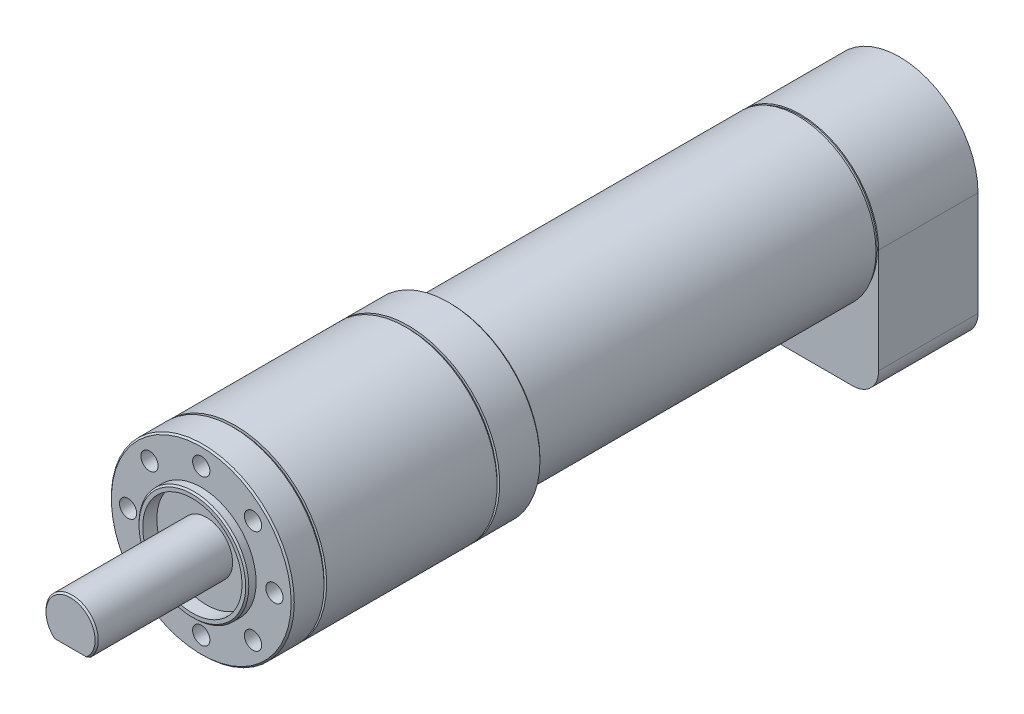
ISO-10303-21;
HEADER;
FILE_DESCRIPTION(('STEP AP214'),'2;1');
FILE_NAME('part.step','',(''),(''),'','','');
FILE_SCHEMA(('AUTOMOTIVE_DESIGN { 1 0 10303 214 1 1 1 1 }'));
ENDSEC;
DATA;
#1=APPLICATION_CONTEXT('core data for automotive mechanical design processes');
#2=APPLICATION_PROTOCOL_DEFINITION('international standard','automotive_design',2000,#1);
#3=PRODUCT_CONTEXT('',#1,'mechanical');
#4=PRODUCT('Part','Part','',(#3));
#5=PRODUCT_RELATED_PRODUCT_CATEGORY('part','',(#4));
#6=PRODUCT_DEFINITION_FORMATION('','',#4);
#7=PRODUCT_DEFINITION_CONTEXT('part definition',#1,'design');
#8=PRODUCT_DEFINITION('design','',#6,#7);
#9=PRODUCT_DEFINITION_SHAPE('','',#8);
#10=(LENGTH_UNIT() NAMED_UNIT(*) SI_UNIT(.MILLI.,.METRE.));
#11=(NAMED_UNIT(*) PLANE_ANGLE_UNIT() SI_UNIT($,.RADIAN.));
#12=(NAMED_UNIT(*) SI_UNIT($,.STERADIAN.) SOLID_ANGLE_UNIT());
#13=UNCERTAINTY_MEASURE_WITH_UNIT(LENGTH_MEASURE(1.E-05),#10,'distance_accuracy_value','');
#14=(GEOMETRIC_REPRESENTATION_CONTEXT(3) GLOBAL_UNCERTAINTY_ASSIGNED_CONTEXT((#13)) GLOBAL_UNIT_ASSIGNED_CONTEXT((#10,
#11,#12)) REPRESENTATION_CONTEXT('',''));
#15=CARTESIAN_POINT('',(0.,0.,0.));
#16=DIRECTION('',(0.,0.,1.));
#17=DIRECTION('',(1.,0.,0.));
#18=AXIS2_PLACEMENT_3D('',#15,#16,#17);
#19=CARTESIAN_POINT('',(0.,0.,47.6));
#20=DIRECTION('',(0.,0.,-1.));
#21=DIRECTION('',(-1.,0.,0.));
#22=AXIS2_PLACEMENT_3D('',#19,#20,#21);
#23=CYLINDRICAL_SURFACE('',#22,17.5);
#24=CARTESIAN_POINT('',(0.,0.,41.1));
#25=DIRECTION('',(0.,0.,1.));
#26=DIRECTION('',(1.,0.,0.));
#27=AXIS2_PLACEMENT_3D('',#24,#25,#26);
#28=CIRCLE('',#27,17.5);
#29=CARTESIAN_POINT('',(17.5,0.,41.1));
#30=VERTEX_POINT('',#29);
#31=EDGE_CURVE('E325',#30,#30,#28,.T.);
#32=ORIENTED_EDGE('',*,*,#31,.F.);
#33=EDGE_LOOP('',(#32));
#34=FACE_BOUND('',#33,.T.);
#35=CARTESIAN_POINT('',(0.,0.,8.5));
#36=DIRECTION('',(0.,0.,-1.));
#37=DIRECTION('',(-1.,0.,0.));
#38=AXIS2_PLACEMENT_3D('',#35,#36,#37);
#39=CIRCLE('',#38,17.5);
#40=CARTESIAN_POINT('',(-17.5,0.,8.5));
#41=VERTEX_POINT('',#40);
#42=EDGE_CURVE('E303',#41,#41,#39,.T.);
#43=ORIENTED_EDGE('',*,*,#42,.F.);
#44=EDGE_LOOP('',(#43));
#45=FACE_BOUND('',#44,.T.);
#46=ADVANCED_FACE('F40',(#34,#45),#23,.T.);
#47=CARTESIAN_POINT('',(0.,0.,46.6));
#48=DIRECTION('',(0.,0.,1.));
#49=DIRECTION('',(1.,0.,0.));
#50=AXIS2_PLACEMENT_3D('',#47,#48,#49);
#51=PLANE('',#50);
#52=CARTESIAN_POINT('',(0.,0.,46.6));
#53=DIRECTION('',(0.,0.,1.));
#54=DIRECTION('',(1.,0.,0.));
#55=AXIS2_PLACEMENT_3D('',#52,#53,#54);
#56=CIRCLE('',#55,9.5);
#57=CARTESIAN_POINT('',(9.5,0.,46.6));
#58=VERTEX_POINT('',#57);
#59=EDGE_CURVE('E433',#58,#58,#56,.T.);
#60=ORIENTED_EDGE('',*,*,#59,.T.);
#61=EDGE_LOOP('',(#60));
#62=FACE_BOUND('',#61,.T.);
#63=CARTESIAN_POINT('',(0.,0.,46.6));
#64=DIRECTION('',(0.,0.,1.));
#65=DIRECTION('',(1.,0.,0.));
#66=AXIS2_PLACEMENT_3D('',#63,#64,#65);
#67=CIRCLE('',#66,5.);
#68=CARTESIAN_POINT('',(5.,0.,46.6));
#69=VERTEX_POINT('',#68);
#70=EDGE_CURVE('E418',#69,#69,#67,.T.);
#71=ORIENTED_EDGE('',*,*,#70,.F.);
#72=EDGE_LOOP('',(#71));
#73=FACE_BOUND('',#72,.T.);
#74=ADVANCED_FACE('F248',(#62,#73),#51,.T.);
#75=CARTESIAN_POINT('',(0.,0.,47.6));
#76=DIRECTION('',(0.,0.,1.));
#77=DIRECTION('',(1.,0.,0.));
#78=AXIS2_PLACEMENT_3D('',#75,#76,#77);
#79=PLANE('',#78);
#80=CARTESIAN_POINT('',(0.,0.,47.6));
#81=DIRECTION('',(0.,0.,1.));
#82=DIRECTION('',(1.,0.,0.));
#83=AXIS2_PLACEMENT_3D('',#80,#81,#82);
#84=CIRCLE('',#83,17.2);
#85=CARTESIAN_POINT('',(17.2,0.,47.6));
#86=VERTEX_POINT('',#85);
#87=EDGE_CURVE('E191',#86,#86,#84,.T.);
#88=ORIENTED_EDGE('',*,*,#87,.T.);
#89=EDGE_LOOP('',(#88));
#90=FACE_BOUND('',#89,.T.);
#91=CARTESIAN_POINT('',(0.,14.,47.6));
#92=DIRECTION('',(0.,0.,1.));
#93=DIRECTION('',(1.,0.,0.));
#94=AXIS2_PLACEMENT_3D('',#91,#92,#93);
#95=CIRCLE('',#94,1.64999999999999);
#96=CARTESIAN_POINT('',(1.64999999999999,14.,47.6));
#97=VERTEX_POINT('',#96);
#98=EDGE_CURVE('E329',#97,#97,#95,.T.);
#99=ORIENTED_EDGE('',*,*,#98,.F.);
#100=EDGE_LOOP('',(#99));
#101=FACE_BOUND('',#100,.T.);
#102=CARTESIAN_POINT('',(-9.89949493661155,9.89949493661138,47.6));
#103=DIRECTION('',(0.,0.,1.));
#104=DIRECTION('',(1.,0.,0.));
#105=AXIS2_PLACEMENT_3D('',#102,#103,#104);
#106=CIRCLE('',#105,1.64999999999999);
#107=CARTESIAN_POINT('',(-8.24949493661156,9.89949493661138,47.6));
#108=VERTEX_POINT('',#107);
#109=EDGE_CURVE('E340',#108,#108,#106,.T.);
#110=ORIENTED_EDGE('',*,*,#109,.F.);
#111=EDGE_LOOP('',(#110));
#112=FACE_BOUND('',#111,.T.);
#113=CARTESIAN_POINT('',(-13.9999999999996,-3.97903932025656E-13,47.6));
#114=DIRECTION('',(0.,0.,1.));
#115=DIRECTION('',(1.,0.,0.));
#116=AXIS2_PLACEMENT_3D('',#113,#114,#115);
#117=CIRCLE('',#116,1.64999999999999);
#118=CARTESIAN_POINT('',(-12.3499999999996,-3.97903932025656E-13,47.6));
#119=VERTEX_POINT('',#118);
#120=EDGE_CURVE('E348',#119,#119,#117,.T.);
#121=ORIENTED_EDGE('',*,*,#120,.F.);
#122=EDGE_LOOP('',(#121));
#123=FACE_BOUND('',#122,.T.);
#124=CARTESIAN_POINT('',(-9.89949493661099,-9.89949493661195,47.6));
#125=DIRECTION('',(0.,0.,1.));
#126=DIRECTION('',(1.,0.,0.));
#127=AXIS2_PLACEMENT_3D('',#124,#125,#126);
#128=CIRCLE('',#127,1.64999999999999);
#129=CARTESIAN_POINT('',(-8.249494936611,-9.89949493661195,47.6));
#130=VERTEX_POINT('',#129);
#131=EDGE_CURVE('E356',#130,#130,#128,.T.);
#132=ORIENTED_EDGE('',*,*,#131,.F.);
#133=EDGE_LOOP('',(#132));
#134=FACE_BOUND('',#133,.T.);
#135=CARTESIAN_POINT('',(7.923788530137E-13,-14.,47.6));
#136=DIRECTION('',(0.,0.,1.));
#137=DIRECTION('',(1.,0.,0.));
#138=AXIS2_PLACEMENT_3D('',#135,#136,#137);
#139=CIRCLE('',#138,1.64999999999999);
#140=CARTESIAN_POINT('',(1.65000000000078,-14.,47.6));
#141=VERTEX_POINT('',#140);
#142=EDGE_CURVE('E364',#141,#141,#139,.T.);
#143=ORIENTED_EDGE('',*,*,#142,.F.);
#144=EDGE_LOOP('',(#143));
#145=FACE_BOUND('',#144,.T.);
#146=CARTESIAN_POINT('',(9.89949493661234,-9.89949493661139,47.6));
#147=DIRECTION('',(0.,0.,1.));
#148=DIRECTION('',(1.,0.,0.));
#149=AXIS2_PLACEMENT_3D('',#146,#147,#148);
#150=CIRCLE('',#149,1.64999999999999);
#151=CARTESIAN_POINT('',(11.5494949366123,-9.89949493661139,47.6));
#152=VERTEX_POINT('',#151);
#153=EDGE_CURVE('E372',#152,#152,#150,.T.);
#154=ORIENTED_EDGE('',*,*,#153,.F.);
#155=EDGE_LOOP('',(#154));
#156=FACE_BOUND('',#155,.T.);
#157=CARTESIAN_POINT('',(14.0000000000004,3.9618942650685E-13,47.6));
#158=DIRECTION('',(0.,0.,1.));
#159=DIRECTION('',(1.,0.,0.));
#160=AXIS2_PLACEMENT_3D('',#157,#158,#159);
#161=CIRCLE('',#160,1.64999999999999);
#162=CARTESIAN_POINT('',(15.6500000000004,3.9618942650685E-13,47.6));
#163=VERTEX_POINT('',#162);
#164=EDGE_CURVE('E380',#163,#163,#161,.T.);
#165=ORIENTED_EDGE('',*,*,#164,.F.);
#166=EDGE_LOOP('',(#165));
#167=FACE_BOUND('',#166,.T.);
#168=CARTESIAN_POINT('',(9.89949493661168,9.89949493661165,47.6));
#169=DIRECTION('',(0.,0.,1.));
#170=DIRECTION('',(1.,0.,0.));
#171=AXIS2_PLACEMENT_3D('',#168,#169,#170);
#172=CIRCLE('',#171,1.64999999999999);
#173=CARTESIAN_POINT('',(11.5494949366117,9.89949493661165,47.6));
#174=VERTEX_POINT('',#173);
#175=EDGE_CURVE('E388',#174,#174,#172,.T.);
#176=ORIENTED_EDGE('',*,*,#175,.F.);
#177=EDGE_LOOP('',(#176));
#178=FACE_BOUND('',#177,.T.);
#179=CARTESIAN_POINT('',(0.,0.,47.6));
#180=DIRECTION('',(0.,0.,1.));
#181=DIRECTION('',(1.,0.,0.));
#182=AXIS2_PLACEMENT_3D('',#179,#180,#181);
#183=CIRCLE('',#182,10.5);
#184=CARTESIAN_POINT('',(10.5,0.,47.6));
#185=VERTEX_POINT('',#184);
#186=EDGE_CURVE('E429',#185,#185,#183,.T.);
#187=ORIENTED_EDGE('',*,*,#186,.F.);
#188=EDGE_LOOP('',(#187));
#189=FACE_BOUND('',#188,.T.);
#190=ADVANCED_FACE('F251',(#90,#101,#112,#123,#134,#145,#156,#167,#178,#189),#79,.T.);
#191=CARTESIAN_POINT('',(0.,0.,47.3));
#192=DIRECTION('',(0.,0.,1.));
#193=DIRECTION('',(1.,0.,0.));
#194=AXIS2_PLACEMENT_3D('',#191,#192,#193);
#195=CIRCLE('',#194,17.5);
#196=CARTESIAN_POINT('',(17.5,0.,47.3));
#197=VERTEX_POINT('',#196);
#198=EDGE_CURVE('E195',#197,#197,#195,.F.);
#199=ORIENTED_EDGE('',*,*,#198,.T.);
#200=EDGE_LOOP('',(#199));
#201=FACE_BOUND('',#200,.T.);
#202=CARTESIAN_POINT('',(0.,0.,41.6));
#203=DIRECTION('',(0.,0.,1.));
#204=DIRECTION('',(1.,0.,0.));
#205=AXIS2_PLACEMENT_3D('',#202,#203,#204);
#206=CIRCLE('',#205,17.5);
#207=CARTESIAN_POINT('',(17.5,0.,41.6));
#208=VERTEX_POINT('',#207);
#209=EDGE_CURVE('E321',#208,#208,#206,.T.);
#210=ORIENTED_EDGE('',*,*,#209,.T.);
#211=EDGE_LOOP('',(#210));
#212=FACE_BOUND('',#211,.T.);
#213=ADVANCED_FACE('F243',(#201,#212),#23,.T.);
#214=CARTESIAN_POINT('',(0.,0.,49.3));
#215=DIRECTION('',(0.,0.,1.));
#216=DIRECTION('',(1.,0.,0.));
#217=AXIS2_PLACEMENT_3D('',#214,#215,#216);
#218=PLANE('',#217);
#219=CARTESIAN_POINT('',(0.,0.,49.3));
#220=DIRECTION('',(0.,0.,1.));
#221=DIRECTION('',(1.,0.,0.));
#222=AXIS2_PLACEMENT_3D('',#219,#220,#221);
#223=CIRCLE('',#222,10.2);
#224=CARTESIAN_POINT('',(10.2,0.,49.3));
#225=VERTEX_POINT('',#224);
#226=EDGE_CURVE('E473',#225,#225,#223,.T.);
#227=ORIENTED_EDGE('',*,*,#226,.T.);
#228=EDGE_LOOP('',(#227));
#229=FACE_BOUND('',#228,.T.);
#230=CARTESIAN_POINT('',(0.,0.,49.3));
#231=DIRECTION('',(0.,0.,1.));
#232=DIRECTION('',(1.,0.,0.));
#233=AXIS2_PLACEMENT_3D('',#230,#231,#232);
#234=CIRCLE('',#233,9.5);
#235=CARTESIAN_POINT('',(9.5,0.,49.3));
#236=VERTEX_POINT('',#235);
#237=EDGE_CURVE('E425',#236,#236,#234,.T.);
#238=ORIENTED_EDGE('',*,*,#237,.F.);
#239=EDGE_LOOP('',(#238));
#240=FACE_BOUND('',#239,.T.);
#241=ADVANCED_FACE('F239',(#229,#240),#218,.T.);
#242=CARTESIAN_POINT('',(0.,0.,49.3));
#243=DIRECTION('',(0.,0.,-1.));
#244=DIRECTION('',(-1.,0.,0.));
#245=AXIS2_PLACEMENT_3D('',#242,#243,#244);
#246=CYLINDRICAL_SURFACE('',#245,10.5);
#247=CARTESIAN_POINT('',(0.,0.,49.));
#248=DIRECTION('',(0.,0.,1.));
#249=DIRECTION('',(1.,0.,0.));
#250=AXIS2_PLACEMENT_3D('',#247,#248,#249);
#251=CIRCLE('',#250,10.5);
#252=CARTESIAN_POINT('',(10.5,0.,49.));
#253=VERTEX_POINT('',#252);
#254=EDGE_CURVE('E470',#253,#253,#251,.F.);
#255=ORIENTED_EDGE('',*,*,#254,.T.);
#256=EDGE_LOOP('',(#255));
#257=FACE_BOUND('',#256,.T.);
#258=ORIENTED_EDGE('',*,*,#186,.T.);
#259=EDGE_LOOP('',(#258));
#260=FACE_BOUND('',#259,.T.);
#261=ADVANCED_FACE('F242',(#257,#260),#246,.T.);
#262=CARTESIAN_POINT('',(0.,0.,46.6));
#263=DIRECTION('',(0.,0.,1.));
#264=DIRECTION('',(1.,0.,0.));
#265=AXIS2_PLACEMENT_3D('',#262,#263,#264);
#266=CYLINDRICAL_SURFACE('',#265,9.5);
#267=ORIENTED_EDGE('',*,*,#59,.F.);
#268=EDGE_LOOP('',(#267));
#269=FACE_BOUND('',#268,.T.);
#270=ORIENTED_EDGE('',*,*,#237,.T.);
#271=EDGE_LOOP('',(#270));
#272=FACE_BOUND('',#271,.T.);
#273=ADVANCED_FACE('F237',(#269,#272),#266,.F.);
#274=CARTESIAN_POINT('',(0.,0.,72.6));
#275=DIRECTION('',(0.,0.,-1.));
#276=DIRECTION('',(-1.,0.,0.));
#277=AXIS2_PLACEMENT_3D('',#274,#275,#276);
#278=CYLINDRICAL_SURFACE('',#277,5.);
#279=DIRECTION('',(0.,0.,1.));
#280=VECTOR('',#279,1.);
#281=CARTESIAN_POINT('',(-3.46987031457949,-3.6,52.6));
#282=LINE('',#281,#280);
#283=CARTESIAN_POINT('',(-3.46987031457949,-3.6,52.6));
#284=VERTEX_POINT('',#283);
#285=CARTESIAN_POINT('',(-3.46987031457949,-3.6,72.3000000000001));
#286=VERTEX_POINT('',#285);
#287=EDGE_CURVE('E414',#284,#286,#282,.T.);
#288=ORIENTED_EDGE('',*,*,#287,.T.);
#289=CARTESIAN_POINT('',(0.,0.,72.3000000000001));
#290=DIRECTION('',(0.,0.,1.));
#291=DIRECTION('',(1.,0.,0.));
#292=AXIS2_PLACEMENT_3D('',#289,#290,#291);
#293=CIRCLE('',#292,5.);
#294=CARTESIAN_POINT('',(3.46987031457949,-3.6,72.3000000000001));
#295=VERTEX_POINT('',#294);
#296=EDGE_CURVE('E478',#286,#295,#293,.F.);
#297=ORIENTED_EDGE('',*,*,#296,.T.);
#298=DIRECTION('',(0.,0.,1.));
#299=VECTOR('',#298,1.);
#300=CARTESIAN_POINT('',(3.46987031457949,-3.6,52.6));
#301=LINE('',#300,#299);
#302=CARTESIAN_POINT('',(3.46987031457949,-3.6,52.6));
#303=VERTEX_POINT('',#302);
#304=EDGE_CURVE('E412',#303,#295,#301,.T.);
#305=ORIENTED_EDGE('',*,*,#304,.F.);
#306=CARTESIAN_POINT('',(0.,0.,52.6));
#307=DIRECTION('',(0.,0.,1.));
#308=DIRECTION('',(1.,0.,0.));
#309=AXIS2_PLACEMENT_3D('',#306,#307,#308);
#310=CIRCLE('',#309,5.);
#311=EDGE_CURVE('E172',#284,#303,#310,.T.);
#312=ORIENTED_EDGE('',*,*,#311,.F.);
#313=EDGE_LOOP('',(#288,#297,#305,#312));
#314=FACE_BOUND('',#313,.T.);
#315=ORIENTED_EDGE('',*,*,#70,.T.);
#316=EDGE_LOOP('',(#315));
#317=FACE_BOUND('',#316,.T.);
#318=ADVANCED_FACE('F233',(#314,#317),#278,.T.);
#319=CARTESIAN_POINT('',(0.,0.,72.6));
#320=DIRECTION('',(0.,0.,1.));
#321=DIRECTION('',(1.,0.,0.));
#322=AXIS2_PLACEMENT_3D('',#319,#320,#321);
#323=PLANE('',#322);
#324=DIRECTION('',(-1.,0.,0.));
#325=VECTOR('',#324,1.);
#326=CARTESIAN_POINT('',(-3.46987031457949,-3.6,72.6));
#327=LINE('',#326,#325);
#328=CARTESIAN_POINT('',(3.02158898594777,-3.6,72.6));
#329=VERTEX_POINT('',#328);
#330=CARTESIAN_POINT('',(-3.02158898594777,-3.6,72.6));
#331=VERTEX_POINT('',#330);
#332=EDGE_CURVE('E166',#329,#331,#327,.T.);
#333=ORIENTED_EDGE('',*,*,#332,.F.);
#334=CARTESIAN_POINT('',(0.,0.,72.6));
#335=DIRECTION('',(0.,0.,1.));
#336=DIRECTION('',(1.,0.,0.));
#337=AXIS2_PLACEMENT_3D('',#334,#335,#336);
#338=CIRCLE('',#337,4.70000000000009);
#339=EDGE_CURVE('E198',#329,#331,#338,.T.);
#340=ORIENTED_EDGE('',*,*,#339,.T.);
#341=EDGE_LOOP('',(#333,#340));
#342=FACE_BOUND('',#341,.T.);
#343=ADVANCED_FACE('F227',(#342),#323,.T.);
#344=CARTESIAN_POINT('',(-3.46987031457949,-3.6,52.6));
#345=DIRECTION('',(0.,1.,0.));
#346=DIRECTION('',(0.,0.,1.));
#347=AXIS2_PLACEMENT_3D('',#344,#345,#346);
#348=PLANE('',#347);
#349=ORIENTED_EDGE('',*,*,#332,.T.);
#350=CARTESIAN_POINT('',(-3.02158898594777,-3.6,72.6));
#351=CARTESIAN_POINT('',(-3.05940313496446,-3.6,72.5756891863581));
#352=CARTESIAN_POINT('',(-3.09709565385285,-3.6,72.5511896855106));
#353=CARTESIAN_POINT('',(-3.17224613011656,-3.6,72.5018397791132));
#354=CARTESIAN_POINT('',(-3.20970410549203,-3.6,72.47698940098));
#355=CARTESIAN_POINT('',(-3.28439979449647,-3.6,72.4269606061702));
#356=CARTESIAN_POINT('',(-3.32163750973018,-3.6,72.401782191888));
#357=CARTESIAN_POINT('',(-3.39590666116629,-3.6,72.3511167277367));
#358=CARTESIAN_POINT('',(-3.4329380811145,-3.6,72.3256296540366));
#359=CARTESIAN_POINT('',(-3.4698703145795,-3.6,72.3000000000001));
#360=B_SPLINE_CURVE_WITH_KNOTS('',3,(#350,#351,#352,#353,#354,#355,#356,#357,#358,#359),
.UNSPECIFIED.,.F.,.F.,(4,2,2,2,4),(0.,0.134863164596307,0.26971584897253,0.404567549643002,
0.539429729244507),.UNSPECIFIED.);
#361=EDGE_CURVE('E211',#331,#286,#360,.T.);
#362=ORIENTED_EDGE('',*,*,#361,.T.);
#363=ORIENTED_EDGE('',*,*,#287,.F.);
#364=DIRECTION('',(-1.,0.,0.));
#365=VECTOR('',#364,1.);
#366=CARTESIAN_POINT('',(-3.46987031457949,-3.6,52.6));
#367=LINE('',#366,#365);
#368=EDGE_CURVE('E409',#303,#284,#367,.T.);
#369=ORIENTED_EDGE('',*,*,#368,.F.);
#370=ORIENTED_EDGE('',*,*,#304,.T.);
#371=CARTESIAN_POINT('',(3.46987031457949,-3.6,72.3000000000001));
#372=CARTESIAN_POINT('',(3.43293808111449,-3.6,72.3256296540366));
#373=CARTESIAN_POINT('',(3.39590666116629,-3.6,72.3511167277367));
#374=CARTESIAN_POINT('',(3.32163750973018,-3.6,72.401782191888));
#375=CARTESIAN_POINT('',(3.28439979449647,-3.6,72.4269606061702));
#376=CARTESIAN_POINT('',(3.20970410549204,-3.6,72.47698940098));
#377=CARTESIAN_POINT('',(3.17224613011656,-3.6,72.5018397791132));
#378=CARTESIAN_POINT('',(3.09709565385286,-3.6,72.5511896855107));
#379=CARTESIAN_POINT('',(3.05940313496447,-3.6,72.5756891863581));
#380=CARTESIAN_POINT('',(3.02158898594779,-3.6,72.6));
#381=B_SPLINE_CURVE_WITH_KNOTS('',3,(#371,#372,#373,#374,#375,#376,#377,#378,#379,#380),
.UNSPECIFIED.,.F.,.F.,(4,2,2,2,4),(0.,0.134862179601507,0.269713880271975,0.404566564648199,
0.539429729244504),.UNSPECIFIED.);
#382=EDGE_CURVE('E202',#295,#329,#381,.T.);
#383=ORIENTED_EDGE('',*,*,#382,.T.);
#384=EDGE_LOOP('',(#349,#362,#363,#369,#370,#383));
#385=FACE_BOUND('',#384,.T.);
#386=ADVANCED_FACE('F221',(#385),#348,.F.);
#387=CARTESIAN_POINT('',(0.,0.,52.6));
#388=DIRECTION('',(0.,0.,1.));
#389=DIRECTION('',(1.,0.,0.));
#390=AXIS2_PLACEMENT_3D('',#387,#388,#389);
#391=PLANE('',#390);
#392=ORIENTED_EDGE('',*,*,#311,.T.);
#393=ORIENTED_EDGE('',*,*,#368,.T.);
#394=EDGE_LOOP('',(#392,#393));
#395=FACE_BOUND('',#394,.T.);
#396=ADVANCED_FACE('F226',(#395),#391,.T.);
#397=CARTESIAN_POINT('',(9.89949493661168,9.89949493661165,39.6));
#398=DIRECTION('',(0.,0.,1.));
#399=DIRECTION('',(1.,0.,0.));
#400=AXIS2_PLACEMENT_3D('',#397,#398,#399);
#401=CONICAL_SURFACE('',#400,1.65,1.02974425867665);
#402=CARTESIAN_POINT('',(9.89949493661168,9.89949493661165,38.6085799786045));
#403=VERTEX_POINT('',#402);
#404=VERTEX_LOOP('',#403);
#405=FACE_BOUND('',#404,.T.);
#406=CARTESIAN_POINT('',(9.89949493661168,9.89949493661165,39.6));
#407=DIRECTION('',(0.,0.,1.));
#408=DIRECTION('',(1.,0.,0.));
#409=AXIS2_PLACEMENT_3D('',#406,#407,#408);
#410=CIRCLE('',#409,1.65);
#411=CARTESIAN_POINT('',(11.5494949366117,9.89949493661165,39.6));
#412=VERTEX_POINT('',#411);
#413=EDGE_CURVE('E160',#412,#412,#410,.T.);
#414=ORIENTED_EDGE('',*,*,#413,.T.);
#415=EDGE_LOOP('',(#414));
#416=FACE_BOUND('',#415,.T.);
#417=ADVANCED_FACE('F491',(#405,#416),#401,.F.);
#418=CARTESIAN_POINT('',(9.89949493661168,9.89949493661165,47.6));
#419=DIRECTION('',(0.,0.,1.));
#420=DIRECTION('',(1.,0.,0.));
#421=AXIS2_PLACEMENT_3D('',#418,#419,#420);
#422=CYLINDRICAL_SURFACE('',#421,1.64999999999999);
#423=ORIENTED_EDGE('',*,*,#413,.F.);
#424=EDGE_LOOP('',(#423));
#425=FACE_BOUND('',#424,.T.);
#426=ORIENTED_EDGE('',*,*,#175,.T.);
#427=EDGE_LOOP('',(#426));
#428=FACE_BOUND('',#427,.T.);
#429=ADVANCED_FACE('F495',(#425,#428),#422,.F.);
#430=CARTESIAN_POINT('',(14.0000000000004,3.9618942650685E-13,39.6));
#431=DIRECTION('',(0.,0.,1.));
#432=DIRECTION('',(1.,0.,0.));
#433=AXIS2_PLACEMENT_3D('',#430,#431,#432);
#434=CONICAL_SURFACE('',#433,1.65,1.02974425867665);
#435=CARTESIAN_POINT('',(14.0000000000004,3.9618942650685E-13,38.6085799786045));
#436=VERTEX_POINT('',#435);
#437=VERTEX_LOOP('',#436);
#438=FACE_BOUND('',#437,.T.);
#439=CARTESIAN_POINT('',(14.0000000000004,3.9618942650685E-13,39.6));
#440=DIRECTION('',(0.,0.,1.));
#441=DIRECTION('',(1.,0.,0.));
#442=AXIS2_PLACEMENT_3D('',#439,#440,#441);
#443=CIRCLE('',#442,1.65);
#444=CARTESIAN_POINT('',(15.6500000000004,3.9618942650685E-13,39.6));
#445=VERTEX_POINT('',#444);
#446=EDGE_CURVE('E384',#445,#445,#443,.T.);
#447=ORIENTED_EDGE('',*,*,#446,.T.);
#448=EDGE_LOOP('',(#447));
#449=FACE_BOUND('',#448,.T.);
#450=ADVANCED_FACE('F501',(#438,#449),#434,.F.);
#451=CARTESIAN_POINT('',(14.0000000000004,3.9618942650685E-13,47.6));
#452=DIRECTION('',(0.,0.,1.));
#453=DIRECTION('',(1.,0.,0.));
#454=AXIS2_PLACEMENT_3D('',#451,#452,#453);
#455=CYLINDRICAL_SURFACE('',#454,1.64999999999999);
#456=ORIENTED_EDGE('',*,*,#446,.F.);
#457=EDGE_LOOP('',(#456));
#458=FACE_BOUND('',#457,.T.);
#459=ORIENTED_EDGE('',*,*,#164,.T.);
#460=EDGE_LOOP('',(#459));
#461=FACE_BOUND('',#460,.T.);
#462=ADVANCED_FACE('F913',(#458,#461),#455,.F.);
#463=CARTESIAN_POINT('',(9.89949493661234,-9.89949493661139,39.6));
#464=DIRECTION('',(0.,0.,1.));
#465=DIRECTION('',(1.,0.,0.));
#466=AXIS2_PLACEMENT_3D('',#463,#464,#465);
#467=CONICAL_SURFACE('',#466,1.65,1.02974425867665);
#468=CARTESIAN_POINT('',(9.89949493661234,-9.89949493661139,38.6085799786045));
#469=VERTEX_POINT('',#468);
#470=VERTEX_LOOP('',#469);
#471=FACE_BOUND('',#470,.T.);
#472=CARTESIAN_POINT('',(9.89949493661234,-9.89949493661139,39.6));
#473=DIRECTION('',(0.,0.,1.));
#474=DIRECTION('',(1.,0.,0.));
#475=AXIS2_PLACEMENT_3D('',#472,#473,#474);
#476=CIRCLE('',#475,1.65);
#477=CARTESIAN_POINT('',(11.5494949366123,-9.89949493661139,39.6));
#478=VERTEX_POINT('',#477);
#479=EDGE_CURVE('E376',#478,#478,#476,.T.);
#480=ORIENTED_EDGE('',*,*,#479,.T.);
#481=EDGE_LOOP('',(#480));
#482=FACE_BOUND('',#481,.T.);
#483=ADVANCED_FACE('F901',(#471,#482),#467,.F.);
#484=CARTESIAN_POINT('',(9.89949493661234,-9.89949493661139,47.6));
#485=DIRECTION('',(0.,0.,1.));
#486=DIRECTION('',(1.,0.,0.));
#487=AXIS2_PLACEMENT_3D('',#484,#485,#486);
#488=CYLINDRICAL_SURFACE('',#487,1.64999999999999);
#489=ORIENTED_EDGE('',*,*,#479,.F.);
#490=EDGE_LOOP('',(#489));
#491=FACE_BOUND('',#490,.T.);
#492=ORIENTED_EDGE('',*,*,#153,.T.);
#493=EDGE_LOOP('',(#492));
#494=FACE_BOUND('',#493,.T.);
#495=ADVANCED_FACE('F891',(#491,#494),#488,.F.);
#496=CARTESIAN_POINT('',(7.923788530137E-13,-14.,39.6));
#497=DIRECTION('',(0.,0.,1.));
#498=DIRECTION('',(1.,0.,0.));
#499=AXIS2_PLACEMENT_3D('',#496,#497,#498);
#500=CONICAL_SURFACE('',#499,1.65,1.02974425867665);
#501=CARTESIAN_POINT('',(7.90176590263901E-13,-14.,38.6085799786045));
#502=VERTEX_POINT('',#501);
#503=VERTEX_LOOP('',#502);
#504=FACE_BOUND('',#503,.T.);
#505=CARTESIAN_POINT('',(7.923788530137E-13,-14.,39.6));
#506=DIRECTION('',(0.,0.,1.));
#507=DIRECTION('',(1.,0.,0.));
#508=AXIS2_PLACEMENT_3D('',#505,#506,#507);
#509=CIRCLE('',#508,1.65);
#510=CARTESIAN_POINT('',(1.65000000000079,-14.,39.6));
#511=VERTEX_POINT('',#510);
#512=EDGE_CURVE('E368',#511,#511,#509,.T.);
#513=ORIENTED_EDGE('',*,*,#512,.T.);
#514=EDGE_LOOP('',(#513));
#515=FACE_BOUND('',#514,.T.);
#516=ADVANCED_FACE('F879',(#504,#515),#500,.F.);
#517=CARTESIAN_POINT('',(7.923788530137E-13,-14.,47.6));
#518=DIRECTION('',(0.,0.,1.));
#519=DIRECTION('',(1.,0.,0.));
#520=AXIS2_PLACEMENT_3D('',#517,#518,#519);
#521=CYLINDRICAL_SURFACE('',#520,1.64999999999999);
#522=ORIENTED_EDGE('',*,*,#512,.F.);
#523=EDGE_LOOP('',(#522));
#524=FACE_BOUND('',#523,.T.);
#525=ORIENTED_EDGE('',*,*,#142,.T.);
#526=EDGE_LOOP('',(#525));
#527=FACE_BOUND('',#526,.T.);
#528=ADVANCED_FACE('F869',(#524,#527),#521,.F.);
#529=CARTESIAN_POINT('',(-9.89949493661099,-9.89949493661195,39.6));
#530=DIRECTION('',(0.,0.,1.));
#531=DIRECTION('',(1.,0.,0.));
#532=AXIS2_PLACEMENT_3D('',#529,#530,#531);
#533=CONICAL_SURFACE('',#532,1.65,1.02974425867665);
#534=CARTESIAN_POINT('',(-9.89949493661099,-9.89949493661195,38.6085799786045));
#535=VERTEX_POINT('',#534);
#536=VERTEX_LOOP('',#535);
#537=FACE_BOUND('',#536,.T.);
#538=CARTESIAN_POINT('',(-9.89949493661099,-9.89949493661195,39.6));
#539=DIRECTION('',(0.,0.,1.));
#540=DIRECTION('',(1.,0.,0.));
#541=AXIS2_PLACEMENT_3D('',#538,#539,#540);
#542=CIRCLE('',#541,1.65);
#543=CARTESIAN_POINT('',(-8.24949493661099,-9.89949493661195,39.6));
#544=VERTEX_POINT('',#543);
#545=EDGE_CURVE('E360',#544,#544,#542,.T.);
#546=ORIENTED_EDGE('',*,*,#545,.T.);
#547=EDGE_LOOP('',(#546));
#548=FACE_BOUND('',#547,.T.);
#549=ADVANCED_FACE('F857',(#537,#548),#533,.F.);
#550=CARTESIAN_POINT('',(-9.89949493661099,-9.89949493661195,47.6));
#551=DIRECTION('',(0.,0.,1.));
#552=DIRECTION('',(1.,0.,0.));
#553=AXIS2_PLACEMENT_3D('',#550,#551,#552);
#554=CYLINDRICAL_SURFACE('',#553,1.64999999999999);
#555=ORIENTED_EDGE('',*,*,#545,.F.);
#556=EDGE_LOOP('',(#555));
#557=FACE_BOUND('',#556,.T.);
#558=ORIENTED_EDGE('',*,*,#131,.T.);
#559=EDGE_LOOP('',(#558));
#560=FACE_BOUND('',#559,.T.);
#561=ADVANCED_FACE('F847',(#557,#560),#554,.F.);
#562=CARTESIAN_POINT('',(-13.9999999999996,-3.97903932025656E-13,39.6));
#563=DIRECTION('',(0.,0.,1.));
#564=DIRECTION('',(1.,0.,0.));
#565=AXIS2_PLACEMENT_3D('',#562,#563,#564);
#566=CONICAL_SURFACE('',#565,1.65,1.02974425867665);
#567=CARTESIAN_POINT('',(-13.9999999999996,-3.97903932025656E-13,38.6085799786045));
#568=VERTEX_POINT('',#567);
#569=VERTEX_LOOP('',#568);
#570=FACE_BOUND('',#569,.T.);
#571=CARTESIAN_POINT('',(-13.9999999999996,-3.97903932025656E-13,39.6));
#572=DIRECTION('',(0.,0.,1.));
#573=DIRECTION('',(1.,0.,0.));
#574=AXIS2_PLACEMENT_3D('',#571,#572,#573);
#575=CIRCLE('',#574,1.65);
#576=CARTESIAN_POINT('',(-12.3499999999996,-3.97903932025656E-13,39.6));
#577=VERTEX_POINT('',#576);
#578=EDGE_CURVE('E352',#577,#577,#575,.T.);
#579=ORIENTED_EDGE('',*,*,#578,.T.);
#580=EDGE_LOOP('',(#579));
#581=FACE_BOUND('',#580,.T.);
#582=ADVANCED_FACE('F835',(#570,#581),#566,.F.);
#583=CARTESIAN_POINT('',(-13.9999999999996,-3.97903932025656E-13,47.6));
#584=DIRECTION('',(0.,0.,1.));
#585=DIRECTION('',(1.,0.,0.));
#586=AXIS2_PLACEMENT_3D('',#583,#584,#585);
#587=CYLINDRICAL_SURFACE('',#586,1.64999999999999);
#588=ORIENTED_EDGE('',*,*,#578,.F.);
#589=EDGE_LOOP('',(#588));
#590=FACE_BOUND('',#589,.T.);
#591=ORIENTED_EDGE('',*,*,#120,.T.);
#592=EDGE_LOOP('',(#591));
#593=FACE_BOUND('',#592,.T.);
#594=ADVANCED_FACE('F825',(#590,#593),#587,.F.);
#595=CARTESIAN_POINT('',(-9.89949493661155,9.89949493661138,39.6));
#596=DIRECTION('',(0.,0.,1.));
#597=DIRECTION('',(1.,0.,0.));
#598=AXIS2_PLACEMENT_3D('',#595,#596,#597);
#599=CONICAL_SURFACE('',#598,1.65,1.02974425867665);
#600=CARTESIAN_POINT('',(-9.89949493661155,9.89949493661138,38.6085799786045));
#601=VERTEX_POINT('',#600);
#602=VERTEX_LOOP('',#601);
#603=FACE_BOUND('',#602,.T.);
#604=CARTESIAN_POINT('',(-9.89949493661155,9.89949493661138,39.6));
#605=DIRECTION('',(0.,0.,1.));
#606=DIRECTION('',(1.,0.,0.));
#607=AXIS2_PLACEMENT_3D('',#604,#605,#606);
#608=CIRCLE('',#607,1.65);
#609=CARTESIAN_POINT('',(-8.24949493661155,9.89949493661138,39.6));
#610=VERTEX_POINT('',#609);
#611=EDGE_CURVE('E344',#610,#610,#608,.T.);
#612=ORIENTED_EDGE('',*,*,#611,.T.);
#613=EDGE_LOOP('',(#612));
#614=FACE_BOUND('',#613,.T.);
#615=ADVANCED_FACE('F813',(#603,#614),#599,.F.);
#616=CARTESIAN_POINT('',(-9.89949493661155,9.89949493661138,47.6));
#617=DIRECTION('',(0.,0.,1.));
#618=DIRECTION('',(1.,0.,0.));
#619=AXIS2_PLACEMENT_3D('',#616,#617,#618);
#620=CYLINDRICAL_SURFACE('',#619,1.64999999999999);
#621=ORIENTED_EDGE('',*,*,#611,.F.);
#622=EDGE_LOOP('',(#621));
#623=FACE_BOUND('',#622,.T.);
#624=ORIENTED_EDGE('',*,*,#109,.T.);
#625=EDGE_LOOP('',(#624));
#626=FACE_BOUND('',#625,.T.);
#627=ADVANCED_FACE('F803',(#623,#626),#620,.F.);
#628=CARTESIAN_POINT('',(0.,14.,39.6));
#629=DIRECTION('',(0.,0.,1.));
#630=DIRECTION('',(1.,0.,0.));
#631=AXIS2_PLACEMENT_3D('',#628,#629,#630);
#632=CONICAL_SURFACE('',#631,1.65,1.02974425867665);
#633=CARTESIAN_POINT('',(0.,14.,38.6085799786045));
#634=VERTEX_POINT('',#633);
#635=VERTEX_LOOP('',#634);
#636=FACE_BOUND('',#635,.T.);
#637=CARTESIAN_POINT('',(0.,14.,39.6));
#638=DIRECTION('',(0.,0.,1.));
#639=DIRECTION('',(1.,0.,0.));
#640=AXIS2_PLACEMENT_3D('',#637,#638,#639);
#641=CIRCLE('',#640,1.65);
#642=CARTESIAN_POINT('',(1.65,14.,39.6));
#643=VERTEX_POINT('',#642);
#644=EDGE_CURVE('E336',#643,#643,#641,.T.);
#645=ORIENTED_EDGE('',*,*,#644,.T.);
#646=EDGE_LOOP('',(#645));
#647=FACE_BOUND('',#646,.T.);
#648=ADVANCED_FACE('F791',(#636,#647),#632,.F.);
#649=CARTESIAN_POINT('',(0.,14.,47.6));
#650=DIRECTION('',(0.,0.,1.));
#651=DIRECTION('',(1.,0.,0.));
#652=AXIS2_PLACEMENT_3D('',#649,#650,#651);
#653=CYLINDRICAL_SURFACE('',#652,1.64999999999999);
#654=ORIENTED_EDGE('',*,*,#644,.F.);
#655=EDGE_LOOP('',(#654));
#656=FACE_BOUND('',#655,.T.);
#657=ORIENTED_EDGE('',*,*,#98,.T.);
#658=EDGE_LOOP('',(#657));
#659=FACE_BOUND('',#658,.T.);
#660=ADVANCED_FACE('F781',(#656,#659),#653,.F.);
#661=CARTESIAN_POINT('',(0.,0.,41.1));
#662=DIRECTION('',(0.,0.,1.));
#663=DIRECTION('',(1.,0.,0.));
#664=AXIS2_PLACEMENT_3D('',#661,#662,#663);
#665=PLANE('',#664);
#666=CARTESIAN_POINT('',(0.,0.,41.1));
#667=DIRECTION('',(0.,0.,1.));
#668=DIRECTION('',(1.,0.,0.));
#669=AXIS2_PLACEMENT_3D('',#666,#667,#668);
#670=CIRCLE('',#669,17.);
#671=CARTESIAN_POINT('',(17.,0.,41.1));
#672=VERTEX_POINT('',#671);
#673=EDGE_CURVE('E317',#672,#672,#670,.T.);
#674=ORIENTED_EDGE('',*,*,#673,.F.);
#675=EDGE_LOOP('',(#674));
#676=FACE_BOUND('',#675,.T.);
#677=ORIENTED_EDGE('',*,*,#31,.T.);
#678=EDGE_LOOP('',(#677));
#679=FACE_BOUND('',#678,.T.);
#680=ADVANCED_FACE('F772',(#676,#679),#665,.T.);
#681=CARTESIAN_POINT('',(0.,0.,41.6));
#682=DIRECTION('',(0.,0.,1.));
#683=DIRECTION('',(1.,0.,0.));
#684=AXIS2_PLACEMENT_3D('',#681,#682,#683);
#685=PLANE('',#684);
#686=CARTESIAN_POINT('',(0.,0.,41.6));
#687=DIRECTION('',(0.,0.,1.));
#688=DIRECTION('',(1.,0.,0.));
#689=AXIS2_PLACEMENT_3D('',#686,#687,#688);
#690=CIRCLE('',#689,17.);
#691=CARTESIAN_POINT('',(17.,0.,41.6));
#692=VERTEX_POINT('',#691);
#693=EDGE_CURVE('E309',#692,#692,#690,.T.);
#694=ORIENTED_EDGE('',*,*,#693,.T.);
#695=EDGE_LOOP('',(#694));
#696=FACE_BOUND('',#695,.T.);
#697=ORIENTED_EDGE('',*,*,#209,.F.);
#698=EDGE_LOOP('',(#697));
#699=FACE_BOUND('',#698,.T.);
#700=ADVANCED_FACE('F763',(#696,#699),#685,.F.);
#701=CARTESIAN_POINT('',(0.,0.,41.1));
#702=DIRECTION('',(0.,0.,1.));
#703=DIRECTION('',(1.,0.,0.));
#704=AXIS2_PLACEMENT_3D('',#701,#702,#703);
#705=CYLINDRICAL_SURFACE('',#704,17.);
#706=ORIENTED_EDGE('',*,*,#673,.T.);
#707=EDGE_LOOP('',(#706));
#708=FACE_BOUND('',#707,.T.);
#709=ORIENTED_EDGE('',*,*,#693,.F.);
#710=EDGE_LOOP('',(#709));
#711=FACE_BOUND('',#710,.T.);
#712=ADVANCED_FACE('F751',(#708,#711),#705,.T.);
#713=CARTESIAN_POINT('',(0.,0.,8.5));
#714=DIRECTION('',(0.,0.,-1.));
#715=DIRECTION('',(-1.,0.,0.));
#716=AXIS2_PLACEMENT_3D('',#713,#714,#715);
#717=PLANE('',#716);
#718=CARTESIAN_POINT('',(0.,0.,8.5));
#719=DIRECTION('',(0.,0.,-1.));
#720=DIRECTION('',(-1.,0.,0.));
#721=AXIS2_PLACEMENT_3D('',#718,#719,#720);
#722=CIRCLE('',#721,17.);
#723=CARTESIAN_POINT('',(-17.,0.,8.5));
#724=VERTEX_POINT('',#723);
#725=EDGE_CURVE('E304',#724,#724,#722,.T.);
#726=ORIENTED_EDGE('',*,*,#725,.F.);
#727=EDGE_LOOP('',(#726));
#728=FACE_BOUND('',#727,.T.);
#729=ORIENTED_EDGE('',*,*,#42,.T.);
#730=EDGE_LOOP('',(#729));
#731=FACE_BOUND('',#730,.T.);
#732=ADVANCED_FACE('F743',(#728,#731),#717,.T.);
#733=CARTESIAN_POINT('',(0.,0.,8.));
#734=DIRECTION('',(0.,0.,-1.));
#735=DIRECTION('',(-1.,0.,0.));
#736=AXIS2_PLACEMENT_3D('',#733,#734,#735);
#737=PLANE('',#736);
#738=CARTESIAN_POINT('',(0.,0.,8.));
#739=DIRECTION('',(0.,0.,-1.));
#740=DIRECTION('',(-1.,0.,0.));
#741=AXIS2_PLACEMENT_3D('',#738,#739,#740);
#742=CIRCLE('',#741,17.);
#743=CARTESIAN_POINT('',(-17.,0.,8.));
#744=VERTEX_POINT('',#743);
#745=EDGE_CURVE('E313',#744,#744,#742,.T.);
#746=ORIENTED_EDGE('',*,*,#745,.T.);
#747=EDGE_LOOP('',(#746));
#748=FACE_BOUND('',#747,.T.);
#749=CARTESIAN_POINT('',(0.,0.,8.));
#750=DIRECTION('',(0.,0.,-1.));
#751=DIRECTION('',(-1.,0.,0.));
#752=AXIS2_PLACEMENT_3D('',#749,#750,#751);
#753=CIRCLE('',#752,17.5);
#754=CARTESIAN_POINT('',(-17.5,0.,8.));
#755=VERTEX_POINT('',#754);
#756=EDGE_CURVE('E300',#755,#755,#753,.T.);
#757=ORIENTED_EDGE('',*,*,#756,.F.);
#758=EDGE_LOOP('',(#757));
#759=FACE_BOUND('',#758,.T.);
#760=ADVANCED_FACE('F524',(#748,#759),#737,.F.);
#761=CARTESIAN_POINT('',(0.,0.,8.5));
#762=DIRECTION('',(0.,0.,-1.));
#763=DIRECTION('',(-1.,0.,0.));
#764=AXIS2_PLACEMENT_3D('',#761,#762,#763);
#765=CYLINDRICAL_SURFACE('',#764,17.);
#766=ORIENTED_EDGE('',*,*,#725,.T.);
#767=EDGE_LOOP('',(#766));
#768=FACE_BOUND('',#767,.T.);
#769=ORIENTED_EDGE('',*,*,#745,.F.);
#770=EDGE_LOOP('',(#769));
#771=FACE_BOUND('',#770,.T.);
#772=ADVANCED_FACE('F519',(#768,#771),#765,.T.);
#773=CARTESIAN_POINT('',(0.,0.,-67.));
#774=DIRECTION('',(0.,0.,1.));
#775=DIRECTION('',(1.,0.,0.));
#776=AXIS2_PLACEMENT_3D('',#773,#774,#775);
#777=CYLINDRICAL_SURFACE('',#776,15.);
#778=CARTESIAN_POINT('',(0.,0.,-66.5));
#779=DIRECTION('',(0.,0.,1.));
#780=DIRECTION('',(1.,0.,0.));
#781=AXIS2_PLACEMENT_3D('',#778,#779,#780);
#782=CIRCLE('',#781,15.);
#783=CARTESIAN_POINT('',(15.,0.,-66.5));
#784=VERTEX_POINT('',#783);
#785=EDGE_CURVE('E150',#784,#784,#782,.T.);
#786=ORIENTED_EDGE('',*,*,#785,.T.);
#787=EDGE_LOOP('',(#786));
#788=FACE_BOUND('',#787,.T.);
#789=CARTESIAN_POINT('',(0.,0.,0.));
#790=DIRECTION('',(0.,0.,1.));
#791=DIRECTION('',(1.,0.,0.));
#792=AXIS2_PLACEMENT_3D('',#789,#790,#791);
#793=CIRCLE('',#792,15.);
#794=CARTESIAN_POINT('',(15.,0.,0.));
#795=VERTEX_POINT('',#794);
#796=EDGE_CURVE('E187',#795,#795,#793,.F.);
#797=ORIENTED_EDGE('',*,*,#796,.T.);
#798=EDGE_LOOP('',(#797));
#799=FACE_BOUND('',#798,.T.);
#800=ADVANCED_FACE('F263',(#788,#799),#777,.T.);
#801=CARTESIAN_POINT('',(0.,0.,0.));
#802=DIRECTION('',(0.,0.,1.));
#803=DIRECTION('',(1.,0.,0.));
#804=AXIS2_PLACEMENT_3D('',#801,#802,#803);
#805=PLANE('',#804);
#806=CARTESIAN_POINT('',(0.,0.,0.));
#807=DIRECTION('',(0.,0.,1.));
#808=DIRECTION('',(1.,0.,0.));
#809=AXIS2_PLACEMENT_3D('',#806,#807,#808);
#810=CIRCLE('',#809,17.2);
#811=CARTESIAN_POINT('',(17.2,0.,0.));
#812=VERTEX_POINT('',#811);
#813=EDGE_CURVE('E186',#812,#812,#810,.F.);
#814=ORIENTED_EDGE('',*,*,#813,.T.);
#815=EDGE_LOOP('',(#814));
#816=FACE_BOUND('',#815,.T.);
#817=ORIENTED_EDGE('',*,*,#796,.F.);
#818=EDGE_LOOP('',(#817));
#819=FACE_BOUND('',#818,.T.);
#820=ADVANCED_FACE('F259',(#816,#819),#805,.F.);
#821=CARTESIAN_POINT('',(0.,0.,0.300000000000036));
#822=DIRECTION('',(0.,0.,1.));
#823=DIRECTION('',(1.,0.,0.));
#824=AXIS2_PLACEMENT_3D('',#821,#822,#823);
#825=CIRCLE('',#824,17.5);
#826=CARTESIAN_POINT('',(17.5,0.,0.300000000000036));
#827=VERTEX_POINT('',#826);
#828=EDGE_CURVE('E182',#827,#827,#825,.T.);
#829=ORIENTED_EDGE('',*,*,#828,.T.);
#830=EDGE_LOOP('',(#829));
#831=FACE_BOUND('',#830,.T.);
#832=ORIENTED_EDGE('',*,*,#756,.T.);
#833=EDGE_LOOP('',(#832));
#834=FACE_BOUND('',#833,.T.);
#835=ADVANCED_FACE('F262',(#831,#834),#23,.T.);
#836=CARTESIAN_POINT('',(0.,0.,-66.5));
#837=DIRECTION('',(0.,0.,1.));
#838=DIRECTION('',(1.,0.,0.));
#839=AXIS2_PLACEMENT_3D('',#836,#837,#838);
#840=PLANE('',#839);
#841=ORIENTED_EDGE('',*,*,#785,.F.);
#842=EDGE_LOOP('',(#841));
#843=FACE_BOUND('',#842,.T.);
#844=CARTESIAN_POINT('',(0.,0.,-66.5));
#845=DIRECTION('',(0.,0.,1.));
#846=DIRECTION('',(1.,0.,0.));
#847=AXIS2_PLACEMENT_3D('',#844,#845,#846);
#848=CIRCLE('',#847,14.75);
#849=CARTESIAN_POINT('',(14.75,0.,-66.5));
#850=VERTEX_POINT('',#849);
#851=EDGE_CURVE('E151',#850,#850,#848,.T.);
#852=ORIENTED_EDGE('',*,*,#851,.T.);
#853=EDGE_LOOP('',(#852));
#854=FACE_BOUND('',#853,.T.);
#855=ADVANCED_FACE('F288',(#843,#854),#840,.F.);
#856=CARTESIAN_POINT('',(0.,0.,-66.5));
#857=DIRECTION('',(0.,0.,-1.));
#858=DIRECTION('',(-1.,0.,0.));
#859=AXIS2_PLACEMENT_3D('',#856,#857,#858);
#860=CYLINDRICAL_SURFACE('',#859,14.75);
#861=ORIENTED_EDGE('',*,*,#851,.F.);
#862=EDGE_LOOP('',(#861));
#863=FACE_BOUND('',#862,.T.);
#864=CARTESIAN_POINT('',(0.,0.,-67.));
#865=DIRECTION('',(0.,0.,1.));
#866=DIRECTION('',(1.,0.,0.));
#867=AXIS2_PLACEMENT_3D('',#864,#865,#866);
#868=CIRCLE('',#867,14.75);
#869=CARTESIAN_POINT('',(14.75,0.,-67.));
#870=VERTEX_POINT('',#869);
#871=EDGE_CURVE('E1027',#870,#870,#868,.T.);
#872=ORIENTED_EDGE('',*,*,#871,.T.);
#873=EDGE_LOOP('',(#872));
#874=FACE_BOUND('',#873,.T.);
#875=ADVANCED_FACE('F293',(#863,#874),#860,.T.);
#876=CARTESIAN_POINT('',(0.,0.,-86.));
#877=DIRECTION('',(0.,0.,1.));
#878=DIRECTION('',(1.,0.,0.));
#879=AXIS2_PLACEMENT_3D('',#876,#877,#878);
#880=PLANE('',#879);
#881=DIRECTION('',(0.,-1.,0.));
#882=VECTOR('',#881,1.);
#883=CARTESIAN_POINT('',(15.,0.,-86.));
#884=LINE('',#883,#882);
#885=CARTESIAN_POINT('',(15.,0.,-86.));
#886=VERTEX_POINT('',#885);
#887=CARTESIAN_POINT('',(15.,-20.,-86.));
#888=VERTEX_POINT('',#887);
#889=EDGE_CURVE('E163',#886,#888,#884,.T.);
#890=ORIENTED_EDGE('',*,*,#889,.T.);
#891=CARTESIAN_POINT('',(9.99999999999999,-20.,-86.));
#892=DIRECTION('',(0.,0.,1.));
#893=DIRECTION('',(1.,0.,0.));
#894=AXIS2_PLACEMENT_3D('',#891,#892,#893);
#895=CIRCLE('',#894,5.);
#896=CARTESIAN_POINT('',(9.99999999999999,-25.,-86.));
#897=VERTEX_POINT('',#896);
#898=EDGE_CURVE('E49',#888,#897,#895,.F.);
#899=ORIENTED_EDGE('',*,*,#898,.T.);
#900=DIRECTION('',(-1.,0.,0.));
#901=VECTOR('',#900,1.);
#902=CARTESIAN_POINT('',(15.,-25.,-86.));
#903=LINE('',#902,#901);
#904=CARTESIAN_POINT('',(-9.99999999999999,-25.,-86.));
#905=VERTEX_POINT('',#904);
#906=EDGE_CURVE('E399',#897,#905,#903,.T.);
#907=ORIENTED_EDGE('',*,*,#906,.T.);
#908=CARTESIAN_POINT('',(-9.99999999999999,-20.,-86.));
#909=DIRECTION('',(0.,0.,1.));
#910=DIRECTION('',(1.,0.,0.));
#911=AXIS2_PLACEMENT_3D('',#908,#909,#910);
#912=CIRCLE('',#911,5.);
#913=CARTESIAN_POINT('',(-15.,-20.,-86.));
#914=VERTEX_POINT('',#913);
#915=EDGE_CURVE('E56',#905,#914,#912,.F.);
#916=ORIENTED_EDGE('',*,*,#915,.T.);
#917=DIRECTION('',(0.,1.,0.));
#918=VECTOR('',#917,1.);
#919=CARTESIAN_POINT('',(-15.,0.,-86.));
#920=LINE('',#919,#918);
#921=CARTESIAN_POINT('',(-15.,0.,-86.));
#922=VERTEX_POINT('',#921);
#923=EDGE_CURVE('E175',#914,#922,#920,.T.);
#924=ORIENTED_EDGE('',*,*,#923,.T.);
#925=CARTESIAN_POINT('',(0.,0.,-86.));
#926=DIRECTION('',(0.,0.,-1.));
#927=DIRECTION('',(1.,0.,0.));
#928=AXIS2_PLACEMENT_3D('',#925,#926,#927);
#929=CIRCLE('',#928,15.);
#930=EDGE_CURVE('E394',#922,#886,#929,.T.);
#931=ORIENTED_EDGE('',*,*,#930,.T.);
#932=EDGE_LOOP('',(#890,#899,#907,#916,#924,#931));
#933=FACE_BOUND('',#932,.T.);
#934=ADVANCED_FACE('F459',(#933),#880,.F.);
#935=CARTESIAN_POINT('',(15.,-25.,-86.));
#936=DIRECTION('',(0.,1.,0.));
#937=DIRECTION('',(0.,0.,1.));
#938=AXIS2_PLACEMENT_3D('',#935,#936,#937);
#939=PLANE('',#938);
#940=ORIENTED_EDGE('',*,*,#906,.F.);
#941=DIRECTION('',(0.,0.,1.));
#942=VECTOR('',#941,1.);
#943=CARTESIAN_POINT('',(9.99999999999999,-25.,-86.));
#944=LINE('',#943,#942);
#945=CARTESIAN_POINT('',(9.99999999999999,-25.,-67.));
#946=VERTEX_POINT('',#945);
#947=EDGE_CURVE('E446',#897,#946,#944,.T.);
#948=ORIENTED_EDGE('',*,*,#947,.T.);
#949=DIRECTION('',(-1.,0.,0.));
#950=VECTOR('',#949,1.);
#951=CARTESIAN_POINT('',(15.,-25.,-67.));
#952=LINE('',#951,#950);
#953=CARTESIAN_POINT('',(-9.99999999999999,-25.,-67.));
#954=VERTEX_POINT('',#953);
#955=EDGE_CURVE('E159',#946,#954,#952,.T.);
#956=ORIENTED_EDGE('',*,*,#955,.T.);
#957=DIRECTION('',(0.,0.,1.));
#958=VECTOR('',#957,1.);
#959=CARTESIAN_POINT('',(-9.99999999999999,-25.,-86.));
#960=LINE('',#959,#958);
#961=EDGE_CURVE('E466',#954,#905,#960,.F.);
#962=ORIENTED_EDGE('',*,*,#961,.T.);
#963=EDGE_LOOP('',(#940,#948,#956,#962));
#964=FACE_BOUND('',#963,.T.);
#965=ADVANCED_FACE('F464',(#964),#939,.F.);
#966=CARTESIAN_POINT('',(-15.,0.,-86.));
#967=DIRECTION('',(1.,0.,0.));
#968=DIRECTION('',(0.,1.,0.));
#969=AXIS2_PLACEMENT_3D('',#966,#967,#968);
#970=PLANE('',#969);
#971=ORIENTED_EDGE('',*,*,#923,.F.);
#972=DIRECTION('',(0.,0.,1.));
#973=VECTOR('',#972,1.);
#974=CARTESIAN_POINT('',(-15.,-20.,-86.));
#975=LINE('',#974,#973);
#976=CARTESIAN_POINT('',(-15.,-20.,-67.));
#977=VERTEX_POINT('',#976);
#978=EDGE_CURVE('E11',#914,#977,#975,.T.);
#979=ORIENTED_EDGE('',*,*,#978,.T.);
#980=DIRECTION('',(0.,1.,0.));
#981=VECTOR('',#980,1.);
#982=CARTESIAN_POINT('',(-15.,0.,-67.));
#983=LINE('',#982,#981);
#984=CARTESIAN_POINT('',(-15.,0.,-67.));
#985=VERTEX_POINT('',#984);
#986=EDGE_CURVE('E397',#977,#985,#983,.T.);
#987=ORIENTED_EDGE('',*,*,#986,.T.);
#988=DIRECTION('',(0.,0.,1.));
#989=VECTOR('',#988,1.);
#990=CARTESIAN_POINT('',(-15.,0.,-86.));
#991=LINE('',#990,#989);
#992=EDGE_CURVE('E146',#922,#985,#991,.T.);
#993=ORIENTED_EDGE('',*,*,#992,.F.);
#994=EDGE_LOOP('',(#971,#979,#987,#993));
#995=FACE_BOUND('',#994,.T.);
#996=ADVANCED_FACE('F511',(#995),#970,.F.);
#997=CARTESIAN_POINT('',(0.,0.,-67.));
#998=DIRECTION('',(0.,0.,1.));
#999=DIRECTION('',(1.,0.,0.));
#1000=AXIS2_PLACEMENT_3D('',#997,#998,#999);
#1001=CIRCLE('',#1000,15.);
#1002=CARTESIAN_POINT('',(15.,0.,-67.));
#1003=VERTEX_POINT('',#1002);
#1004=EDGE_CURVE('E139',#1003,#985,#1001,.T.);
#1005=ORIENTED_EDGE('',*,*,#1004,.F.);
#1006=DIRECTION('',(0.,0.,1.));
#1007=VECTOR('',#1006,1.);
#1008=CARTESIAN_POINT('',(15.,0.,-86.));
#1009=LINE('',#1008,#1007);
#1010=EDGE_CURVE('E144',#886,#1003,#1009,.T.);
#1011=ORIENTED_EDGE('',*,*,#1010,.F.);
#1012=ORIENTED_EDGE('',*,*,#930,.F.);
#1013=ORIENTED_EDGE('',*,*,#992,.T.);
#1014=EDGE_LOOP('',(#1005,#1011,#1012,#1013));
#1015=FACE_BOUND('',#1014,.T.);
#1016=ADVANCED_FACE('F141',(#1015),#777,.T.);
#1017=CARTESIAN_POINT('',(15.,0.,-86.));
#1018=DIRECTION('',(-1.,0.,0.));
#1019=DIRECTION('',(0.,-1.,0.));
#1020=AXIS2_PLACEMENT_3D('',#1017,#1018,#1019);
#1021=PLANE('',#1020);
#1022=DIRECTION('',(0.,-1.,0.));
#1023=VECTOR('',#1022,1.);
#1024=CARTESIAN_POINT('',(15.,0.,-67.));
#1025=LINE('',#1024,#1023);
#1026=CARTESIAN_POINT('',(15.,-20.,-67.));
#1027=VERTEX_POINT('',#1026);
#1028=EDGE_CURVE('E153',#1003,#1027,#1025,.T.);
#1029=ORIENTED_EDGE('',*,*,#1028,.T.);
#1030=DIRECTION('',(0.,0.,1.));
#1031=VECTOR('',#1030,1.);
#1032=CARTESIAN_POINT('',(15.,-20.,-86.));
#1033=LINE('',#1032,#1031);
#1034=EDGE_CURVE('E64',#1027,#888,#1033,.F.);
#1035=ORIENTED_EDGE('',*,*,#1034,.T.);
#1036=ORIENTED_EDGE('',*,*,#889,.F.);
#1037=ORIENTED_EDGE('',*,*,#1010,.T.);
#1038=EDGE_LOOP('',(#1029,#1035,#1036,#1037));
#1039=FACE_BOUND('',#1038,.T.);
#1040=ADVANCED_FACE('F162',(#1039),#1021,.F.);
#1041=CARTESIAN_POINT('',(0.,0.,-67.));
#1042=DIRECTION('',(0.,0.,1.));
#1043=DIRECTION('',(1.,0.,0.));
#1044=AXIS2_PLACEMENT_3D('',#1041,#1042,#1043);
#1045=PLANE('',#1044);
#1046=ORIENTED_EDGE('',*,*,#955,.F.);
#1047=CARTESIAN_POINT('',(9.99999999999999,-20.,-67.));
#1048=DIRECTION('',(0.,0.,1.));
#1049=DIRECTION('',(1.,0.,0.));
#1050=AXIS2_PLACEMENT_3D('',#1047,#1048,#1049);
#1051=CIRCLE('',#1050,5.);
#1052=EDGE_CURVE('E157',#946,#1027,#1051,.T.);
#1053=ORIENTED_EDGE('',*,*,#1052,.T.);
#1054=ORIENTED_EDGE('',*,*,#1028,.F.);
#1055=ORIENTED_EDGE('',*,*,#1004,.T.);
#1056=ORIENTED_EDGE('',*,*,#986,.F.);
#1057=CARTESIAN_POINT('',(-9.99999999999999,-20.,-67.));
#1058=DIRECTION('',(0.,0.,1.));
#1059=DIRECTION('',(1.,0.,0.));
#1060=AXIS2_PLACEMENT_3D('',#1057,#1058,#1059);
#1061=CIRCLE('',#1060,5.);
#1062=EDGE_CURVE('E448',#977,#954,#1061,.T.);
#1063=ORIENTED_EDGE('',*,*,#1062,.T.);
#1064=EDGE_LOOP('',(#1046,#1053,#1054,#1055,#1056,#1063));
#1065=FACE_BOUND('',#1064,.T.);
#1066=ORIENTED_EDGE('',*,*,#871,.F.);
#1067=EDGE_LOOP('',(#1066));
#1068=FACE_BOUND('',#1067,.T.);
#1069=ADVANCED_FACE('F155',(#1065,#1068),#1045,.T.);
#1070=CARTESIAN_POINT('',(0.,0.,0.300000000000036));
#1071=DIRECTION('',(0.,0.,1.));
#1072=DIRECTION('',(1.,0.,0.));
#1073=AXIS2_PLACEMENT_3D('',#1070,#1071,#1072);
#1074=CONICAL_SURFACE('',#1073,17.5,0.785398163397454);
#1075=ORIENTED_EDGE('',*,*,#813,.F.);
#1076=EDGE_LOOP('',(#1075));
#1077=FACE_BOUND('',#1076,.T.);
#1078=ORIENTED_EDGE('',*,*,#828,.F.);
#1079=EDGE_LOOP('',(#1078));
#1080=FACE_BOUND('',#1079,.T.);
#1081=ADVANCED_FACE('F268',(#1077,#1080),#1074,.T.);
#1082=CARTESIAN_POINT('',(0.,0.,47.6));
#1083=DIRECTION('',(0.,0.,-1.));
#1084=DIRECTION('',(-1.,0.,0.));
#1085=AXIS2_PLACEMENT_3D('',#1082,#1083,#1084);
#1086=CONICAL_SURFACE('',#1085,17.2,0.785398163397431);
#1087=ORIENTED_EDGE('',*,*,#198,.F.);
#1088=EDGE_LOOP('',(#1087));
#1089=FACE_BOUND('',#1088,.T.);
#1090=ORIENTED_EDGE('',*,*,#87,.F.);
#1091=EDGE_LOOP('',(#1090));
#1092=FACE_BOUND('',#1091,.T.);
#1093=ADVANCED_FACE('F270',(#1089,#1092),#1086,.T.);
#1094=CARTESIAN_POINT('',(0.,0.,72.6));
#1095=DIRECTION('',(0.,0.,-1.));
#1096=DIRECTION('',(-1.,0.,0.));
#1097=AXIS2_PLACEMENT_3D('',#1094,#1095,#1096);
#1098=CONICAL_SURFACE('',#1097,4.70000000000009,0.785398163397419);
#1099=ORIENTED_EDGE('',*,*,#382,.F.);
#1100=ORIENTED_EDGE('',*,*,#296,.F.);
#1101=ORIENTED_EDGE('',*,*,#361,.F.);
#1102=ORIENTED_EDGE('',*,*,#339,.F.);
#1103=EDGE_LOOP('',(#1099,#1100,#1101,#1102));
#1104=FACE_BOUND('',#1103,.T.);
#1105=ADVANCED_FACE('F217',(#1104),#1098,.T.);
#1106=CARTESIAN_POINT('',(0.,0.,49.3));
#1107=DIRECTION('',(0.,0.,-1.));
#1108=DIRECTION('',(-1.,0.,0.));
#1109=AXIS2_PLACEMENT_3D('',#1106,#1107,#1108);
#1110=CONICAL_SURFACE('',#1109,10.2,0.785398163397434);
#1111=ORIENTED_EDGE('',*,*,#254,.F.);
#1112=EDGE_LOOP('',(#1111));
#1113=FACE_BOUND('',#1112,.T.);
#1114=ORIENTED_EDGE('',*,*,#226,.F.);
#1115=EDGE_LOOP('',(#1114));
#1116=FACE_BOUND('',#1115,.T.);
#1117=ADVANCED_FACE('F277',(#1113,#1116),#1110,.T.);
#1118=CARTESIAN_POINT('',(9.99999999999999,-20.,-86.));
#1119=DIRECTION('',(0.,0.,1.));
#1120=DIRECTION('',(1.,0.,0.));
#1121=AXIS2_PLACEMENT_3D('',#1118,#1119,#1120);
#1122=CYLINDRICAL_SURFACE('',#1121,5.);
#1123=ORIENTED_EDGE('',*,*,#898,.F.);
#1124=ORIENTED_EDGE('',*,*,#1034,.F.);
#1125=ORIENTED_EDGE('',*,*,#1052,.F.);
#1126=ORIENTED_EDGE('',*,*,#947,.F.);
#1127=EDGE_LOOP('',(#1123,#1124,#1125,#1126));
#1128=FACE_BOUND('',#1127,.T.);
#1129=ADVANCED_FACE('F467',(#1128),#1122,.T.);
#1130=CARTESIAN_POINT('',(-9.99999999999999,-20.,-86.));
#1131=DIRECTION('',(0.,0.,1.));
#1132=DIRECTION('',(1.,0.,0.));
#1133=AXIS2_PLACEMENT_3D('',#1130,#1131,#1132);
#1134=CYLINDRICAL_SURFACE('',#1133,5.);
#1135=ORIENTED_EDGE('',*,*,#915,.F.);
#1136=ORIENTED_EDGE('',*,*,#961,.F.);
#1137=ORIENTED_EDGE('',*,*,#1062,.F.);
#1138=ORIENTED_EDGE('',*,*,#978,.F.);
#1139=EDGE_LOOP('',(#1135,#1136,#1137,#1138));
#1140=FACE_BOUND('',#1139,.T.);
#1141=ADVANCED_FACE('F42',(#1140),#1134,.T.);
#1142=CLOSED_SHELL('',(#46,#74,#190,#213,#241,#261,#273,#318,#343,#386,#396,#417,#429,#450,#462,
#483,#495,#516,#528,#549,#561,#582,#594,#615,#627,#648,#660,#680,#700,#712,#732,#760,#772,#800,
#820,#835,#855,#875,#934,#965,#996,#1016,#1040,#1069,#1081,#1093,#1105,#1117,#1129,#1141));
#1143=MANIFOLD_SOLID_BREP('B2',#1142);
#1144=ADVANCED_BREP_SHAPE_REPRESENTATION('',(#18,#1143),#14);
#1145=SHAPE_DEFINITION_REPRESENTATION(#9,#1144);
ENDSEC;
END-ISO-10303-21;
